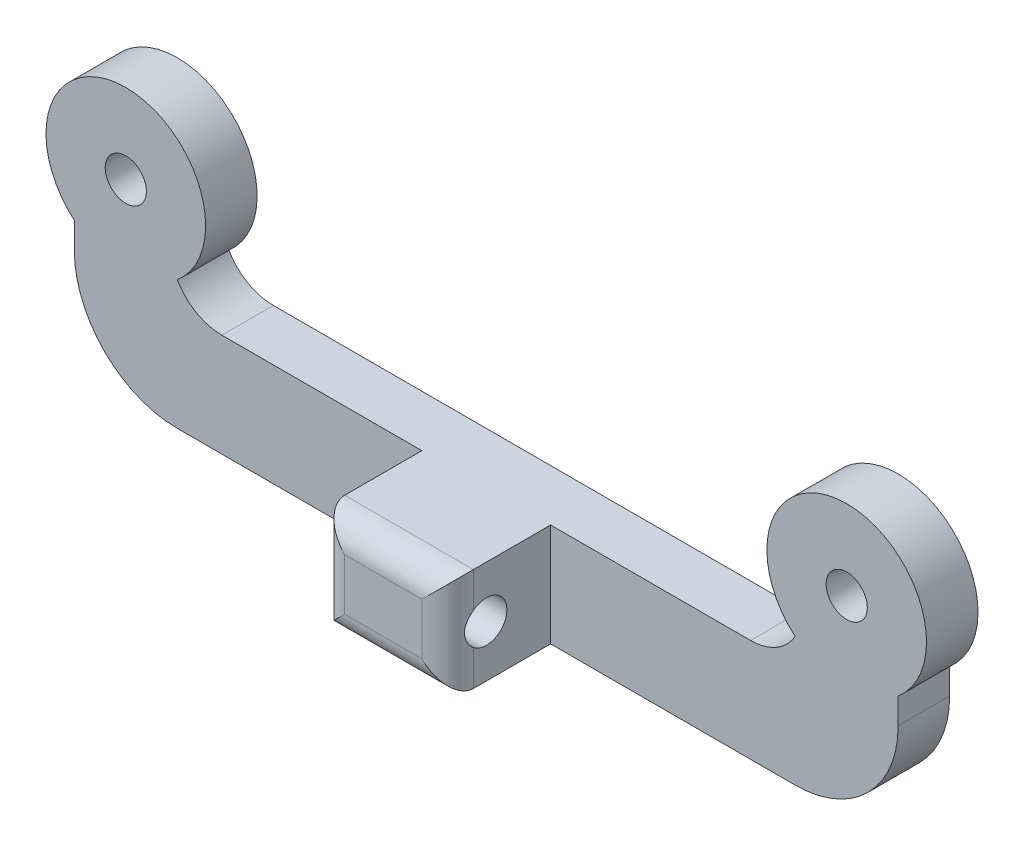
ISO-10303-21;
HEADER;
FILE_DESCRIPTION(('STEP AP214'),'2;1');
FILE_NAME('part.step','',(''),(''),'','','');
FILE_SCHEMA(('AUTOMOTIVE_DESIGN { 1 0 10303 214 1 1 1 1 }'));
ENDSEC;
DATA;
#1=APPLICATION_CONTEXT('core data for automotive mechanical design processes');
#2=APPLICATION_PROTOCOL_DEFINITION('international standard','automotive_design',2000,#1);
#3=PRODUCT_CONTEXT('',#1,'mechanical');
#4=PRODUCT('Part','Part','',(#3));
#5=PRODUCT_RELATED_PRODUCT_CATEGORY('part','',(#4));
#6=PRODUCT_DEFINITION_FORMATION('','',#4);
#7=PRODUCT_DEFINITION_CONTEXT('part definition',#1,'design');
#8=PRODUCT_DEFINITION('design','',#6,#7);
#9=PRODUCT_DEFINITION_SHAPE('','',#8);
#10=(LENGTH_UNIT() NAMED_UNIT(*) SI_UNIT(.MILLI.,.METRE.));
#11=(NAMED_UNIT(*) PLANE_ANGLE_UNIT() SI_UNIT($,.RADIAN.));
#12=(NAMED_UNIT(*) SI_UNIT($,.STERADIAN.) SOLID_ANGLE_UNIT());
#13=UNCERTAINTY_MEASURE_WITH_UNIT(LENGTH_MEASURE(1.E-05),#10,'distance_accuracy_value','');
#14=(GEOMETRIC_REPRESENTATION_CONTEXT(3) GLOBAL_UNCERTAINTY_ASSIGNED_CONTEXT((#13)) GLOBAL_UNIT_ASSIGNED_CONTEXT((#10,
#11,#12)) REPRESENTATION_CONTEXT('',''));
#15=CARTESIAN_POINT('',(0.,0.,0.));
#16=DIRECTION('',(0.,0.,1.));
#17=DIRECTION('',(1.,0.,0.));
#18=AXIS2_PLACEMENT_3D('',#15,#16,#17);
#19=CARTESIAN_POINT('',(56.,0.,4.));
#20=DIRECTION('',(0.,0.,1.));
#21=DIRECTION('',(1.,0.,0.));
#22=AXIS2_PLACEMENT_3D('',#19,#20,#21);
#23=PLANE('',#22);
#24=DIRECTION('',(0.,-1.,0.));
#25=VECTOR('',#24,1.);
#26=CARTESIAN_POINT('',(-4.,-4.7370877129308,4.));
#27=LINE('',#26,#25);
#28=CARTESIAN_POINT('',(-4.,-4.7370877129308,4.));
#29=VERTEX_POINT('',#28);
#30=CARTESIAN_POINT('',(-4.,-6.7370877129308,4.));
#31=VERTEX_POINT('',#30);
#32=EDGE_CURVE('E249',#29,#31,#27,.T.);
#33=ORIENTED_EDGE('',*,*,#32,.T.);
#34=CARTESIAN_POINT('',(4.,-6.7370877129308,4.));
#35=DIRECTION('',(0.,0.,1.));
#36=DIRECTION('',(1.,0.,0.));
#37=AXIS2_PLACEMENT_3D('',#34,#35,#36);
#38=CIRCLE('',#37,8.);
#39=CARTESIAN_POINT('',(4.,-14.7370877129308,4.));
#40=VERTEX_POINT('',#39);
#41=EDGE_CURVE('E241',#31,#40,#38,.T.);
#42=ORIENTED_EDGE('',*,*,#41,.T.);
#43=DIRECTION('',(1.,0.,0.));
#44=VECTOR('',#43,1.);
#45=CARTESIAN_POINT('',(-4.,-14.7370877129308,4.));
#46=LINE('',#45,#44);
#47=CARTESIAN_POINT('',(23.,-14.7370877129308,4.));
#48=VERTEX_POINT('',#47);
#49=EDGE_CURVE('E227',#40,#48,#46,.T.);
#50=ORIENTED_EDGE('',*,*,#49,.T.);
#51=DIRECTION('',(0.,-1.,0.));
#52=VECTOR('',#51,1.);
#53=CARTESIAN_POINT('',(23.,-6.73708771293081,4.));
#54=LINE('',#53,#52);
#55=CARTESIAN_POINT('',(23.,-6.7370877129308,4.));
#56=VERTEX_POINT('',#55);
#57=EDGE_CURVE('E187',#56,#48,#54,.T.);
#58=ORIENTED_EDGE('',*,*,#57,.F.);
#59=DIRECTION('',(-1.,0.,0.));
#60=VECTOR('',#59,1.);
#61=CARTESIAN_POINT('',(4.,-6.7370877129308,4.));
#62=LINE('',#61,#60);
#63=CARTESIAN_POINT('',(7.46410161513775,-6.7370877129308,4.));
#64=VERTEX_POINT('',#63);
#65=EDGE_CURVE('E171',#56,#64,#62,.T.);
#66=ORIENTED_EDGE('',*,*,#65,.T.);
#67=CARTESIAN_POINT('',(7.46410161513775,-2.7370877129308,4.));
#68=DIRECTION('',(0.,0.,1.));
#69=DIRECTION('',(1.,0.,0.));
#70=AXIS2_PLACEMENT_3D('',#67,#68,#69);
#71=CIRCLE('',#70,4.);
#72=CARTESIAN_POINT('',(4.,-4.7370877129308,4.));
#73=VERTEX_POINT('',#72);
#74=EDGE_CURVE('E11',#64,#73,#71,.F.);
#75=ORIENTED_EDGE('',*,*,#74,.T.);
#76=CARTESIAN_POINT('',(0.,0.,4.));
#77=DIRECTION('',(0.,0.,1.));
#78=DIRECTION('',(1.,0.,0.));
#79=AXIS2_PLACEMENT_3D('',#76,#77,#78);
#80=CIRCLE('',#79,6.2);
#81=EDGE_CURVE('E170',#73,#29,#80,.T.);
#82=ORIENTED_EDGE('',*,*,#81,.T.);
#83=EDGE_LOOP('',(#33,#42,#50,#58,#66,#75,#82));
#84=FACE_BOUND('',#83,.T.);
#85=CARTESIAN_POINT('',(0.,0.,4.));
#86=DIRECTION('',(0.,0.,1.));
#87=DIRECTION('',(1.,0.,0.));
#88=AXIS2_PLACEMENT_3D('',#85,#86,#87);
#89=CIRCLE('',#88,1.6);
#90=CARTESIAN_POINT('',(1.6,0.,4.));
#91=VERTEX_POINT('',#90);
#92=EDGE_CURVE('E213',#91,#91,#89,.T.);
#93=ORIENTED_EDGE('',*,*,#92,.F.);
#94=EDGE_LOOP('',(#93));
#95=FACE_BOUND('',#94,.T.);
#96=ADVANCED_FACE('F33',(#84,#95),#23,.T.);
#97=CARTESIAN_POINT('',(33.,-14.7370877129308,4.));
#98=VERTEX_POINT('',#97);
#99=CARTESIAN_POINT('',(52.,-14.7370877129308,4.));
#100=VERTEX_POINT('',#99);
#101=EDGE_CURVE('E224',#98,#100,#46,.T.);
#102=ORIENTED_EDGE('',*,*,#101,.T.);
#103=CARTESIAN_POINT('',(52.,-6.7370877129308,4.));
#104=DIRECTION('',(0.,0.,1.));
#105=DIRECTION('',(1.,0.,0.));
#106=AXIS2_PLACEMENT_3D('',#103,#104,#105);
#107=CIRCLE('',#106,8.);
#108=CARTESIAN_POINT('',(60.,-6.7370877129308,4.));
#109=VERTEX_POINT('',#108);
#110=EDGE_CURVE('E237',#100,#109,#107,.T.);
#111=ORIENTED_EDGE('',*,*,#110,.T.);
#112=DIRECTION('',(0.,1.,0.));
#113=VECTOR('',#112,1.);
#114=CARTESIAN_POINT('',(60.,-4.7370877129308,4.));
#115=LINE('',#114,#113);
#116=CARTESIAN_POINT('',(60.,-4.73708771293081,4.));
#117=VERTEX_POINT('',#116);
#118=EDGE_CURVE('E221',#109,#117,#115,.T.);
#119=ORIENTED_EDGE('',*,*,#118,.T.);
#120=CARTESIAN_POINT('',(56.,0.,4.));
#121=DIRECTION('',(0.,0.,1.));
#122=DIRECTION('',(1.,0.,0.));
#123=AXIS2_PLACEMENT_3D('',#120,#121,#122);
#124=CIRCLE('',#123,6.2);
#125=CARTESIAN_POINT('',(52.,-4.7370877129308,4.));
#126=VERTEX_POINT('',#125);
#127=EDGE_CURVE('E246',#117,#126,#124,.T.);
#128=ORIENTED_EDGE('',*,*,#127,.T.);
#129=CARTESIAN_POINT('',(48.5358983848623,-2.7370877129308,4.));
#130=DIRECTION('',(0.,0.,1.));
#131=DIRECTION('',(1.,0.,0.));
#132=AXIS2_PLACEMENT_3D('',#129,#130,#131);
#133=CIRCLE('',#132,4.);
#134=CARTESIAN_POINT('',(48.5358983848623,-6.7370877129308,4.));
#135=VERTEX_POINT('',#134);
#136=EDGE_CURVE('E167',#126,#135,#133,.F.);
#137=ORIENTED_EDGE('',*,*,#136,.T.);
#138=CARTESIAN_POINT('',(33.,-6.7370877129308,4.));
#139=VERTEX_POINT('',#138);
#140=EDGE_CURVE('E158',#135,#139,#62,.T.);
#141=ORIENTED_EDGE('',*,*,#140,.T.);
#142=DIRECTION('',(0.,1.,0.));
#143=VECTOR('',#142,1.);
#144=CARTESIAN_POINT('',(33.,-6.7370877129308,4.));
#145=LINE('',#144,#143);
#146=EDGE_CURVE('E164',#98,#139,#145,.T.);
#147=ORIENTED_EDGE('',*,*,#146,.F.);
#148=EDGE_LOOP('',(#102,#111,#119,#128,#137,#141,#147));
#149=FACE_BOUND('',#148,.T.);
#150=CARTESIAN_POINT('',(56.,0.,4.));
#151=DIRECTION('',(0.,0.,1.));
#152=DIRECTION('',(1.,0.,0.));
#153=AXIS2_PLACEMENT_3D('',#150,#151,#152);
#154=CIRCLE('',#153,1.6);
#155=CARTESIAN_POINT('',(57.6,0.,4.));
#156=VERTEX_POINT('',#155);
#157=EDGE_CURVE('E205',#156,#156,#154,.T.);
#158=ORIENTED_EDGE('',*,*,#157,.F.);
#159=EDGE_LOOP('',(#158));
#160=FACE_BOUND('',#159,.T.);
#161=ADVANCED_FACE('F161',(#149,#160),#23,.T.);
#162=CARTESIAN_POINT('',(56.,0.,0.));
#163=DIRECTION('',(0.,0.,1.));
#164=DIRECTION('',(1.,0.,0.));
#165=AXIS2_PLACEMENT_3D('',#162,#163,#164);
#166=PLANE('',#165);
#167=CARTESIAN_POINT('',(0.,0.,0.));
#168=DIRECTION('',(0.,0.,1.));
#169=DIRECTION('',(1.,0.,0.));
#170=AXIS2_PLACEMENT_3D('',#167,#168,#169);
#171=CIRCLE('',#170,1.6);
#172=CARTESIAN_POINT('',(1.6,0.,0.));
#173=VERTEX_POINT('',#172);
#174=EDGE_CURVE('E208',#173,#173,#171,.T.);
#175=ORIENTED_EDGE('',*,*,#174,.T.);
#176=EDGE_LOOP('',(#175));
#177=FACE_BOUND('',#176,.T.);
#178=DIRECTION('',(0.,1.,0.));
#179=VECTOR('',#178,1.);
#180=CARTESIAN_POINT('',(60.,-4.7370877129308,0.));
#181=LINE('',#180,#179);
#182=CARTESIAN_POINT('',(60.,-6.7370877129308,0.));
#183=VERTEX_POINT('',#182);
#184=CARTESIAN_POINT('',(60.,-4.73708771293081,0.));
#185=VERTEX_POINT('',#184);
#186=EDGE_CURVE('E255',#183,#185,#181,.T.);
#187=ORIENTED_EDGE('',*,*,#186,.F.);
#188=CARTESIAN_POINT('',(52.,-6.7370877129308,0.));
#189=DIRECTION('',(0.,0.,1.));
#190=DIRECTION('',(1.,0.,0.));
#191=AXIS2_PLACEMENT_3D('',#188,#189,#190);
#192=CIRCLE('',#191,8.);
#193=CARTESIAN_POINT('',(52.,-14.7370877129308,0.));
#194=VERTEX_POINT('',#193);
#195=EDGE_CURVE('E230',#183,#194,#192,.F.);
#196=ORIENTED_EDGE('',*,*,#195,.T.);
#197=DIRECTION('',(1.,0.,0.));
#198=VECTOR('',#197,1.);
#199=CARTESIAN_POINT('',(-4.,-14.7370877129308,0.));
#200=LINE('',#199,#198);
#201=CARTESIAN_POINT('',(4.,-14.7370877129308,0.));
#202=VERTEX_POINT('',#201);
#203=EDGE_CURVE('E216',#202,#194,#200,.T.);
#204=ORIENTED_EDGE('',*,*,#203,.F.);
#205=CARTESIAN_POINT('',(4.,-6.7370877129308,0.));
#206=DIRECTION('',(0.,0.,1.));
#207=DIRECTION('',(1.,0.,0.));
#208=AXIS2_PLACEMENT_3D('',#205,#206,#207);
#209=CIRCLE('',#208,8.);
#210=CARTESIAN_POINT('',(-4.,-6.7370877129308,0.));
#211=VERTEX_POINT('',#210);
#212=EDGE_CURVE('E333',#202,#211,#209,.F.);
#213=ORIENTED_EDGE('',*,*,#212,.T.);
#214=DIRECTION('',(0.,-1.,0.));
#215=VECTOR('',#214,1.);
#216=CARTESIAN_POINT('',(-4.,-4.7370877129308,0.));
#217=LINE('',#216,#215);
#218=CARTESIAN_POINT('',(-4.,-4.7370877129308,0.));
#219=VERTEX_POINT('',#218);
#220=EDGE_CURVE('E264',#219,#211,#217,.T.);
#221=ORIENTED_EDGE('',*,*,#220,.F.);
#222=CARTESIAN_POINT('',(0.,0.,0.));
#223=DIRECTION('',(0.,0.,1.));
#224=DIRECTION('',(1.,0.,0.));
#225=AXIS2_PLACEMENT_3D('',#222,#223,#224);
#226=CIRCLE('',#225,6.2);
#227=CARTESIAN_POINT('',(4.,-4.7370877129308,0.));
#228=VERTEX_POINT('',#227);
#229=EDGE_CURVE('E262',#228,#219,#226,.T.);
#230=ORIENTED_EDGE('',*,*,#229,.F.);
#231=CARTESIAN_POINT('',(7.46410161513775,-2.7370877129308,0.));
#232=DIRECTION('',(0.,0.,1.));
#233=DIRECTION('',(1.,0.,0.));
#234=AXIS2_PLACEMENT_3D('',#231,#232,#233);
#235=CIRCLE('',#234,4.);
#236=CARTESIAN_POINT('',(7.46410161513775,-6.7370877129308,0.));
#237=VERTEX_POINT('',#236);
#238=EDGE_CURVE('E41',#228,#237,#235,.T.);
#239=ORIENTED_EDGE('',*,*,#238,.T.);
#240=DIRECTION('',(-1.,0.,0.));
#241=VECTOR('',#240,1.);
#242=CARTESIAN_POINT('',(4.,-6.7370877129308,0.));
#243=LINE('',#242,#241);
#244=CARTESIAN_POINT('',(48.5358983848623,-6.7370877129308,0.));
#245=VERTEX_POINT('',#244);
#246=EDGE_CURVE('E260',#245,#237,#243,.T.);
#247=ORIENTED_EDGE('',*,*,#246,.F.);
#248=CARTESIAN_POINT('',(48.5358983848623,-2.7370877129308,0.));
#249=DIRECTION('',(0.,0.,1.));
#250=DIRECTION('',(1.,0.,0.));
#251=AXIS2_PLACEMENT_3D('',#248,#249,#250);
#252=CIRCLE('',#251,4.);
#253=CARTESIAN_POINT('',(52.,-4.7370877129308,0.));
#254=VERTEX_POINT('',#253);
#255=EDGE_CURVE('E564',#245,#254,#252,.T.);
#256=ORIENTED_EDGE('',*,*,#255,.T.);
#257=CARTESIAN_POINT('',(56.,0.,0.));
#258=DIRECTION('',(0.,0.,1.));
#259=DIRECTION('',(1.,0.,0.));
#260=AXIS2_PLACEMENT_3D('',#257,#258,#259);
#261=CIRCLE('',#260,6.2);
#262=EDGE_CURVE('E257',#185,#254,#261,.T.);
#263=ORIENTED_EDGE('',*,*,#262,.F.);
#264=EDGE_LOOP('',(#187,#196,#204,#213,#221,#230,#239,#247,#256,#263));
#265=FACE_BOUND('',#264,.T.);
#266=CARTESIAN_POINT('',(56.,0.,0.));
#267=DIRECTION('',(0.,0.,1.));
#268=DIRECTION('',(1.,0.,0.));
#269=AXIS2_PLACEMENT_3D('',#266,#267,#268);
#270=CIRCLE('',#269,1.6);
#271=CARTESIAN_POINT('',(57.6,0.,0.));
#272=VERTEX_POINT('',#271);
#273=EDGE_CURVE('E209',#272,#272,#270,.T.);
#274=ORIENTED_EDGE('',*,*,#273,.T.);
#275=EDGE_LOOP('',(#274));
#276=FACE_BOUND('',#275,.T.);
#277=ADVANCED_FACE('F337',(#177,#265,#276),#166,.F.);
#278=CARTESIAN_POINT('',(-4.,-14.7370877129308,4.));
#279=DIRECTION('',(0.,1.,0.));
#280=DIRECTION('',(0.,0.,1.));
#281=AXIS2_PLACEMENT_3D('',#278,#279,#280);
#282=PLANE('',#281);
#283=ORIENTED_EDGE('',*,*,#203,.T.);
#284=DIRECTION('',(0.,0.,-1.));
#285=VECTOR('',#284,1.);
#286=CARTESIAN_POINT('',(52.,-14.7370877129308,4.));
#287=LINE('',#286,#285);
#288=EDGE_CURVE('E235',#194,#100,#287,.F.);
#289=ORIENTED_EDGE('',*,*,#288,.T.);
#290=ORIENTED_EDGE('',*,*,#101,.F.);
#291=DIRECTION('',(0.,0.,-1.));
#292=VECTOR('',#291,1.);
#293=CARTESIAN_POINT('',(33.,-14.7370877129308,12.));
#294=LINE('',#293,#292);
#295=CARTESIAN_POINT('',(33.,-14.7370877129308,10.));
#296=VERTEX_POINT('',#295);
#297=EDGE_CURVE('E182',#296,#98,#294,.T.);
#298=ORIENTED_EDGE('',*,*,#297,.F.);
#299=DIRECTION('',(1.,0.,0.));
#300=VECTOR('',#299,1.);
#301=CARTESIAN_POINT('',(23.,-14.7370877129308,10.));
#302=LINE('',#301,#300);
#303=CARTESIAN_POINT('',(23.,-14.7370877129308,10.));
#304=VERTEX_POINT('',#303);
#305=EDGE_CURVE('E317',#296,#304,#302,.F.);
#306=ORIENTED_EDGE('',*,*,#305,.T.);
#307=DIRECTION('',(0.,0.,-1.));
#308=VECTOR('',#307,1.);
#309=CARTESIAN_POINT('',(23.,-14.7370877129308,12.));
#310=LINE('',#309,#308);
#311=EDGE_CURVE('E212',#304,#48,#310,.T.);
#312=ORIENTED_EDGE('',*,*,#311,.T.);
#313=ORIENTED_EDGE('',*,*,#49,.F.);
#314=DIRECTION('',(0.,0.,-1.));
#315=VECTOR('',#314,1.);
#316=CARTESIAN_POINT('',(4.,-14.7370877129308,4.));
#317=LINE('',#316,#315);
#318=EDGE_CURVE('E232',#40,#202,#317,.T.);
#319=ORIENTED_EDGE('',*,*,#318,.T.);
#320=EDGE_LOOP('',(#283,#289,#290,#298,#306,#312,#313,#319));
#321=FACE_BOUND('',#320,.T.);
#322=ADVANCED_FACE('F343',(#321),#282,.F.);
#323=CARTESIAN_POINT('',(60.,-4.7370877129308,4.));
#324=DIRECTION('',(-1.,0.,0.));
#325=DIRECTION('',(0.,0.,1.));
#326=AXIS2_PLACEMENT_3D('',#323,#324,#325);
#327=PLANE('',#326);
#328=ORIENTED_EDGE('',*,*,#118,.F.);
#329=DIRECTION('',(0.,0.,-1.));
#330=VECTOR('',#329,1.);
#331=CARTESIAN_POINT('',(60.,-6.7370877129308,4.));
#332=LINE('',#331,#330);
#333=EDGE_CURVE('E319',#109,#183,#332,.T.);
#334=ORIENTED_EDGE('',*,*,#333,.T.);
#335=ORIENTED_EDGE('',*,*,#186,.T.);
#336=DIRECTION('',(0.,0.,-1.));
#337=VECTOR('',#336,1.);
#338=CARTESIAN_POINT('',(60.,-4.73708771293081,4.));
#339=LINE('',#338,#337);
#340=EDGE_CURVE('E274',#117,#185,#339,.T.);
#341=ORIENTED_EDGE('',*,*,#340,.F.);
#342=EDGE_LOOP('',(#328,#334,#335,#341));
#343=FACE_BOUND('',#342,.T.);
#344=ADVANCED_FACE('F350',(#343),#327,.F.);
#345=CARTESIAN_POINT('',(56.,0.,4.));
#346=DIRECTION('',(0.,0.,-1.));
#347=DIRECTION('',(-1.,0.,0.));
#348=AXIS2_PLACEMENT_3D('',#345,#346,#347);
#349=CYLINDRICAL_SURFACE('',#348,6.2);
#350=ORIENTED_EDGE('',*,*,#262,.T.);
#351=DIRECTION('',(0.,0.,-1.));
#352=VECTOR('',#351,1.);
#353=CARTESIAN_POINT('',(52.,-4.7370877129308,4.));
#354=LINE('',#353,#352);
#355=EDGE_CURVE('E272',#126,#254,#354,.T.);
#356=ORIENTED_EDGE('',*,*,#355,.F.);
#357=ORIENTED_EDGE('',*,*,#127,.F.);
#358=ORIENTED_EDGE('',*,*,#340,.T.);
#359=EDGE_LOOP('',(#350,#356,#357,#358));
#360=FACE_BOUND('',#359,.T.);
#361=ADVANCED_FACE('F433',(#360),#349,.T.);
#362=CARTESIAN_POINT('',(4.,-6.7370877129308,4.));
#363=DIRECTION('',(0.,-1.,0.));
#364=DIRECTION('',(0.,0.,-1.));
#365=AXIS2_PLACEMENT_3D('',#362,#363,#364);
#366=PLANE('',#365);
#367=ORIENTED_EDGE('',*,*,#140,.F.);
#368=DIRECTION('',(0.,0.,-1.));
#369=VECTOR('',#368,1.);
#370=CARTESIAN_POINT('',(48.5358983848623,-6.7370877129308,4.));
#371=LINE('',#370,#369);
#372=EDGE_CURVE('E563',#135,#245,#371,.T.);
#373=ORIENTED_EDGE('',*,*,#372,.T.);
#374=ORIENTED_EDGE('',*,*,#246,.T.);
#375=DIRECTION('',(0.,0.,-1.));
#376=VECTOR('',#375,1.);
#377=CARTESIAN_POINT('',(7.46410161513775,-6.7370877129308,4.));
#378=LINE('',#377,#376);
#379=EDGE_CURVE('E48',#237,#64,#378,.F.);
#380=ORIENTED_EDGE('',*,*,#379,.T.);
#381=ORIENTED_EDGE('',*,*,#65,.F.);
#382=DIRECTION('',(0.,0.,-1.));
#383=VECTOR('',#382,1.);
#384=CARTESIAN_POINT('',(23.,-6.73708771293081,12.));
#385=LINE('',#384,#383);
#386=CARTESIAN_POINT('',(23.,-6.73708771293081,10.));
#387=VERTEX_POINT('',#386);
#388=EDGE_CURVE('E183',#387,#56,#385,.T.);
#389=ORIENTED_EDGE('',*,*,#388,.F.);
#390=DIRECTION('',(-1.,0.,0.));
#391=VECTOR('',#390,1.);
#392=CARTESIAN_POINT('',(33.,-6.7370877129308,10.));
#393=LINE('',#392,#391);
#394=CARTESIAN_POINT('',(33.,-6.7370877129308,10.));
#395=VERTEX_POINT('',#394);
#396=EDGE_CURVE('E178',#387,#395,#393,.F.);
#397=ORIENTED_EDGE('',*,*,#396,.T.);
#398=DIRECTION('',(0.,0.,-1.));
#399=VECTOR('',#398,1.);
#400=CARTESIAN_POINT('',(33.,-6.7370877129308,12.));
#401=LINE('',#400,#399);
#402=EDGE_CURVE('E174',#395,#139,#401,.T.);
#403=ORIENTED_EDGE('',*,*,#402,.T.);
#404=EDGE_LOOP('',(#367,#373,#374,#380,#381,#389,#397,#403));
#405=FACE_BOUND('',#404,.T.);
#406=ADVANCED_FACE('F175',(#405),#366,.F.);
#407=CARTESIAN_POINT('',(0.,0.,4.));
#408=DIRECTION('',(0.,0.,-1.));
#409=DIRECTION('',(-1.,0.,0.));
#410=AXIS2_PLACEMENT_3D('',#407,#408,#409);
#411=CYLINDRICAL_SURFACE('',#410,6.2);
#412=ORIENTED_EDGE('',*,*,#229,.T.);
#413=DIRECTION('',(0.,0.,-1.));
#414=VECTOR('',#413,1.);
#415=CARTESIAN_POINT('',(-4.,-4.7370877129308,4.));
#416=LINE('',#415,#414);
#417=EDGE_CURVE('E252',#29,#219,#416,.T.);
#418=ORIENTED_EDGE('',*,*,#417,.F.);
#419=ORIENTED_EDGE('',*,*,#81,.F.);
#420=DIRECTION('',(0.,0.,-1.));
#421=VECTOR('',#420,1.);
#422=CARTESIAN_POINT('',(4.,-4.7370877129308,4.));
#423=LINE('',#422,#421);
#424=EDGE_CURVE('E269',#73,#228,#423,.T.);
#425=ORIENTED_EDGE('',*,*,#424,.T.);
#426=EDGE_LOOP('',(#412,#418,#419,#425));
#427=FACE_BOUND('',#426,.T.);
#428=ADVANCED_FACE('F360',(#427),#411,.T.);
#429=CARTESIAN_POINT('',(-4.,-4.7370877129308,4.));
#430=DIRECTION('',(1.,0.,0.));
#431=DIRECTION('',(0.,1.,0.));
#432=AXIS2_PLACEMENT_3D('',#429,#430,#431);
#433=PLANE('',#432);
#434=ORIENTED_EDGE('',*,*,#220,.T.);
#435=DIRECTION('',(0.,0.,-1.));
#436=VECTOR('',#435,1.);
#437=CARTESIAN_POINT('',(-4.,-6.7370877129308,4.));
#438=LINE('',#437,#436);
#439=EDGE_CURVE('E239',#211,#31,#438,.F.);
#440=ORIENTED_EDGE('',*,*,#439,.T.);
#441=ORIENTED_EDGE('',*,*,#32,.F.);
#442=ORIENTED_EDGE('',*,*,#417,.T.);
#443=EDGE_LOOP('',(#434,#440,#441,#442));
#444=FACE_BOUND('',#443,.T.);
#445=ADVANCED_FACE('F364',(#444),#433,.F.);
#446=CARTESIAN_POINT('',(0.,0.,4.));
#447=DIRECTION('',(0.,0.,-1.));
#448=DIRECTION('',(-1.,0.,0.));
#449=AXIS2_PLACEMENT_3D('',#446,#447,#448);
#450=CYLINDRICAL_SURFACE('',#449,1.6);
#451=ORIENTED_EDGE('',*,*,#92,.T.);
#452=EDGE_LOOP('',(#451));
#453=FACE_BOUND('',#452,.T.);
#454=ORIENTED_EDGE('',*,*,#174,.F.);
#455=EDGE_LOOP('',(#454));
#456=FACE_BOUND('',#455,.T.);
#457=ADVANCED_FACE('F417',(#453,#456),#450,.F.);
#458=CARTESIAN_POINT('',(56.,0.,4.));
#459=DIRECTION('',(0.,0.,-1.));
#460=DIRECTION('',(-1.,0.,0.));
#461=AXIS2_PLACEMENT_3D('',#458,#459,#460);
#462=CYLINDRICAL_SURFACE('',#461,1.6);
#463=ORIENTED_EDGE('',*,*,#157,.T.);
#464=EDGE_LOOP('',(#463));
#465=FACE_BOUND('',#464,.T.);
#466=ORIENTED_EDGE('',*,*,#273,.F.);
#467=EDGE_LOOP('',(#466));
#468=FACE_BOUND('',#467,.T.);
#469=ADVANCED_FACE('F414',(#465,#468),#462,.F.);
#470=CARTESIAN_POINT('',(23.,-6.73708771293081,12.));
#471=DIRECTION('',(1.,0.,0.));
#472=DIRECTION('',(0.,0.,-1.));
#473=AXIS2_PLACEMENT_3D('',#470,#471,#472);
#474=PLANE('',#473);
#475=ORIENTED_EDGE('',*,*,#311,.F.);
#476=DIRECTION('',(0.,-1.,0.));
#477=VECTOR('',#476,1.);
#478=CARTESIAN_POINT('',(23.,-6.73708771293081,10.));
#479=LINE('',#478,#477);
#480=CARTESIAN_POINT('',(23.,-11.9860873126105,10.));
#481=VERTEX_POINT('',#480);
#482=EDGE_CURVE('E314',#304,#481,#479,.F.);
#483=ORIENTED_EDGE('',*,*,#482,.T.);
#484=CARTESIAN_POINT('',(23.,-10.7370877129308,9.));
#485=DIRECTION('',(-1.,0.,0.));
#486=DIRECTION('',(0.,0.,1.));
#487=AXIS2_PLACEMENT_3D('',#484,#485,#486);
#488=CIRCLE('',#487,1.6);
#489=CARTESIAN_POINT('',(23.,-9.48808811325112,10.));
#490=VERTEX_POINT('',#489);
#491=EDGE_CURVE('E331',#490,#481,#488,.T.);
#492=ORIENTED_EDGE('',*,*,#491,.F.);
#493=DIRECTION('',(0.,-1.,0.));
#494=VECTOR('',#493,1.);
#495=CARTESIAN_POINT('',(23.,-6.73708771293081,10.));
#496=LINE('',#495,#494);
#497=EDGE_CURVE('E312',#490,#387,#496,.F.);
#498=ORIENTED_EDGE('',*,*,#497,.T.);
#499=ORIENTED_EDGE('',*,*,#388,.T.);
#500=ORIENTED_EDGE('',*,*,#57,.T.);
#501=EDGE_LOOP('',(#475,#483,#492,#498,#499,#500));
#502=FACE_BOUND('',#501,.T.);
#503=ADVANCED_FACE('F373',(#502),#474,.F.);
#504=CARTESIAN_POINT('',(33.,-6.7370877129308,12.));
#505=DIRECTION('',(-1.,0.,0.));
#506=DIRECTION('',(0.,0.,1.));
#507=AXIS2_PLACEMENT_3D('',#504,#505,#506);
#508=PLANE('',#507);
#509=ORIENTED_EDGE('',*,*,#402,.F.);
#510=DIRECTION('',(0.,1.,0.));
#511=VECTOR('',#510,1.);
#512=CARTESIAN_POINT('',(33.,-14.7370877129308,10.));
#513=LINE('',#512,#511);
#514=CARTESIAN_POINT('',(33.,-9.48808811325112,10.));
#515=VERTEX_POINT('',#514);
#516=EDGE_CURVE('E389',#395,#515,#513,.F.);
#517=ORIENTED_EDGE('',*,*,#516,.T.);
#518=CARTESIAN_POINT('',(33.,-10.7370877129308,9.));
#519=DIRECTION('',(-1.,0.,0.));
#520=DIRECTION('',(0.,0.,1.));
#521=AXIS2_PLACEMENT_3D('',#518,#519,#520);
#522=CIRCLE('',#521,1.6);
#523=CARTESIAN_POINT('',(33.,-11.9860873126105,10.));
#524=VERTEX_POINT('',#523);
#525=EDGE_CURVE('E191',#524,#515,#522,.F.);
#526=ORIENTED_EDGE('',*,*,#525,.F.);
#527=DIRECTION('',(0.,1.,0.));
#528=VECTOR('',#527,1.);
#529=CARTESIAN_POINT('',(33.,-14.7370877129308,10.));
#530=LINE('',#529,#528);
#531=EDGE_CURVE('E294',#524,#296,#530,.F.);
#532=ORIENTED_EDGE('',*,*,#531,.T.);
#533=ORIENTED_EDGE('',*,*,#297,.T.);
#534=ORIENTED_EDGE('',*,*,#146,.T.);
#535=EDGE_LOOP('',(#509,#517,#526,#532,#533,#534));
#536=FACE_BOUND('',#535,.T.);
#537=ADVANCED_FACE('F185',(#536),#508,.F.);
#538=CARTESIAN_POINT('',(0.,0.,12.));
#539=DIRECTION('',(0.,0.,1.));
#540=DIRECTION('',(1.,0.,0.));
#541=AXIS2_PLACEMENT_3D('',#538,#539,#540);
#542=PLANE('',#541);
#543=DIRECTION('',(0.,1.,0.));
#544=VECTOR('',#543,1.);
#545=CARTESIAN_POINT('',(31.,-6.7370877129308,12.));
#546=LINE('',#545,#544);
#547=CARTESIAN_POINT('',(31.,-12.7370877129308,12.));
#548=VERTEX_POINT('',#547);
#549=CARTESIAN_POINT('',(31.,-8.7370877129308,12.));
#550=VERTEX_POINT('',#549);
#551=EDGE_CURVE('E287',#548,#550,#546,.T.);
#552=ORIENTED_EDGE('',*,*,#551,.T.);
#553=DIRECTION('',(-1.,0.,0.));
#554=VECTOR('',#553,1.);
#555=CARTESIAN_POINT('',(23.,-8.7370877129308,12.));
#556=LINE('',#555,#554);
#557=CARTESIAN_POINT('',(25.,-8.7370877129308,12.));
#558=VERTEX_POINT('',#557);
#559=EDGE_CURVE('E293',#550,#558,#556,.T.);
#560=ORIENTED_EDGE('',*,*,#559,.T.);
#561=DIRECTION('',(0.,-1.,0.));
#562=VECTOR('',#561,1.);
#563=CARTESIAN_POINT('',(25.,-14.7370877129308,12.));
#564=LINE('',#563,#562);
#565=CARTESIAN_POINT('',(25.,-12.7370877129308,12.));
#566=VERTEX_POINT('',#565);
#567=EDGE_CURVE('E281',#558,#566,#564,.T.);
#568=ORIENTED_EDGE('',*,*,#567,.T.);
#569=DIRECTION('',(1.,0.,0.));
#570=VECTOR('',#569,1.);
#571=CARTESIAN_POINT('',(33.,-12.7370877129308,12.));
#572=LINE('',#571,#570);
#573=EDGE_CURVE('E276',#566,#548,#572,.T.);
#574=ORIENTED_EDGE('',*,*,#573,.T.);
#575=EDGE_LOOP('',(#552,#560,#568,#574));
#576=FACE_BOUND('',#575,.T.);
#577=ADVANCED_FACE('F405',(#576),#542,.T.);
#578=CARTESIAN_POINT('',(62.201,-10.7370877129308,9.));
#579=DIRECTION('',(-1.,0.,0.));
#580=DIRECTION('',(0.,0.,1.));
#581=AXIS2_PLACEMENT_3D('',#578,#579,#580);
#582=CYLINDRICAL_SURFACE('',#581,1.6);
#583=ORIENTED_EDGE('',*,*,#491,.T.);
#584=CARTESIAN_POINT('',(23.,-11.9860873126105,10.));
#585=CARTESIAN_POINT('',(22.9999993559734,-11.9583502592157,10.0346462395051));
#586=CARTESIAN_POINT('',(23.0009002039694,-11.9291900752005,10.0681088382742));
#587=CARTESIAN_POINT('',(23.0041306999931,-11.8682507038677,10.1324452054838));
#588=CARTESIAN_POINT('',(23.006459429436,-11.8364732116855,10.1633206238064));
#589=CARTESIAN_POINT('',(23.0150169164172,-11.7376381633769,10.2516743298706));
#590=CARTESIAN_POINT('',(23.0228201297238,-11.66695919662,10.3050279486858));
#591=CARTESIAN_POINT('',(23.0396644576238,-11.5180684898146,10.399225094104));
#592=CARTESIAN_POINT('',(23.0487036412819,-11.4398685550859,10.4400878190101));
#593=CARTESIAN_POINT('',(23.0653956157477,-11.2776752343233,10.5084771052936));
#594=CARTESIAN_POINT('',(23.0730484335836,-11.1936819612785,10.5360039266811));
#595=CARTESIAN_POINT('',(23.0850165099016,-11.0201490779698,10.577340450326));
#596=CARTESIAN_POINT('',(23.0892541589458,-10.9305278611808,10.5908331062224));
#597=CARTESIAN_POINT('',(23.0928965584347,-10.7502130544017,10.6024928561739));
#598=CARTESIAN_POINT('',(23.0923029721345,-10.6595198442045,10.6006652245561));
#599=CARTESIAN_POINT('',(23.0865929504131,-10.4839000848738,10.5821976650696));
#600=CARTESIAN_POINT('',(23.0816780548487,-10.398896063488,10.5662175503069));
#601=CARTESIAN_POINT('',(23.068874265902,-10.2327179466679,10.5208668779799));
#602=CARTESIAN_POINT('',(23.0609829610285,-10.1515470169741,10.4914854586074));
#603=CARTESIAN_POINT('',(23.0440725399581,-9.99307083472429,10.4192329808007));
#604=CARTESIAN_POINT('',(23.0350298547342,-9.91591629004008,10.3760380138994));
#605=CARTESIAN_POINT('',(23.0187163389806,-9.76972289048775,10.2774762955987));
#606=CARTESIAN_POINT('',(23.0114421545913,-9.70066880439001,10.2221329683899));
#607=CARTESIAN_POINT('',(23.0044891719505,-9.61005901755263,10.1362876948085));
#608=CARTESIAN_POINT('',(23.0028568689952,-9.58436288899236,10.1102102990544));
#609=CARTESIAN_POINT('',(23.0006126490429,-9.534819264009,10.0563553446216));
#610=CARTESIAN_POINT('',(22.9999998793483,-9.51097023867631,10.0285792268681));
#611=CARTESIAN_POINT('',(23.,-9.48808811325112,10.));
#612=B_SPLINE_CURVE_WITH_KNOTS('',3,(#584,#585,#586,#587,#588,#589,#590,#591,#592,#593,#594,
#595,#596,#597,#598,#599,#600,#601,#602,#603,#604,#605,#606,#607,#608,#609,#610,#611),
.UNSPECIFIED.,.F.,.F.,(4,2,2,2,2,2,2,2,2,2,2,2,2,4),(0.,0.133035993810696,0.265986492545871,
0.531326037257326,0.796255684662105,1.0611801665276,1.33196752676627,1.60266166666071,
1.86136330281575,2.12027499124519,2.38576794331623,2.65075340566711,2.76061030830083,
2.8703752846545),.UNSPECIFIED.);
#613=EDGE_CURVE('E393',#481,#490,#612,.T.);
#614=ORIENTED_EDGE('',*,*,#613,.T.);
#615=EDGE_LOOP('',(#583,#614));
#616=FACE_BOUND('',#615,.T.);
#617=ORIENTED_EDGE('',*,*,#525,.T.);
#618=CARTESIAN_POINT('',(33.,-9.48808811325112,10.));
#619=CARTESIAN_POINT('',(33.0000006440266,-9.51582516664594,10.0346462395051));
#620=CARTESIAN_POINT('',(32.9990997960306,-9.54498535066115,10.0681088382742));
#621=CARTESIAN_POINT('',(32.9958693000069,-9.60592472199396,10.1324452054838));
#622=CARTESIAN_POINT('',(32.993540570564,-9.63770221417607,10.1633206238064));
#623=CARTESIAN_POINT('',(32.9849830835828,-9.73653726248468,10.2516743298706));
#624=CARTESIAN_POINT('',(32.9771798702762,-9.80721622924163,10.3050279486858));
#625=CARTESIAN_POINT('',(32.9603355423762,-9.95610693604701,10.399225094104));
#626=CARTESIAN_POINT('',(32.9512963587181,-10.0343068707757,10.4400878190101));
#627=CARTESIAN_POINT('',(32.9346043842523,-10.1965001915384,10.5084771052936));
#628=CARTESIAN_POINT('',(32.9269515664164,-10.2804934645831,10.5360039266811));
#629=CARTESIAN_POINT('',(32.9149834900984,-10.4540263478919,10.577340450326));
#630=CARTESIAN_POINT('',(32.9107458410542,-10.5436475646809,10.5908331062224));
#631=CARTESIAN_POINT('',(32.9071034415653,-10.7239623714599,10.6024928561739));
#632=CARTESIAN_POINT('',(32.9076970278655,-10.8146555816571,10.6006652245561));
#633=CARTESIAN_POINT('',(32.9134070495869,-10.9902753409878,10.5821976650696));
#634=CARTESIAN_POINT('',(32.9183219451513,-11.0752793623736,10.5662175503069));
#635=CARTESIAN_POINT('',(32.931125734098,-11.2414574791937,10.5208668779799));
#636=CARTESIAN_POINT('',(32.9390170389715,-11.3226284088875,10.4914854586075));
#637=CARTESIAN_POINT('',(32.9559274600419,-11.4811045911373,10.4192329808007));
#638=CARTESIAN_POINT('',(32.9649701452658,-11.5582591358215,10.3760380138994));
#639=CARTESIAN_POINT('',(32.9812836610194,-11.7044525353739,10.2774762955987));
#640=CARTESIAN_POINT('',(32.9885578454087,-11.7735066214716,10.2221329683899));
#641=CARTESIAN_POINT('',(32.9955108280495,-11.864116408309,10.1362876948085));
#642=CARTESIAN_POINT('',(32.9971431310048,-11.8898125368692,10.1102102990544));
#643=CARTESIAN_POINT('',(32.9993873509571,-11.9393561618526,10.0563553446216));
#644=CARTESIAN_POINT('',(33.0000001206517,-11.9632051871853,10.0285792268681));
#645=CARTESIAN_POINT('',(33.,-11.9860873126105,10.));
#646=B_SPLINE_CURVE_WITH_KNOTS('',3,(#618,#619,#620,#621,#622,#623,#624,#625,#626,#627,#628,
#629,#630,#631,#632,#633,#634,#635,#636,#637,#638,#639,#640,#641,#642,#643,#644,#645),
.UNSPECIFIED.,.F.,.F.,(4,2,2,2,2,2,2,2,2,2,2,2,2,4),(0.,0.133035993810696,0.265986492545871,
0.531326037257326,0.796255684662105,1.0611801665276,1.33196752676627,1.6026616666607,
1.86136330281575,2.12027499124519,2.38576794331622,2.65075340566711,2.76061030830083,
2.87037528465451),.UNSPECIFIED.);
#647=EDGE_CURVE('E304',#515,#524,#646,.T.);
#648=ORIENTED_EDGE('',*,*,#647,.T.);
#649=EDGE_LOOP('',(#617,#648));
#650=FACE_BOUND('',#649,.T.);
#651=ADVANCED_FACE('F401',(#616,#650),#582,.F.);
#652=CARTESIAN_POINT('',(25.,0.,10.));
#653=DIRECTION('',(0.,1.,0.));
#654=DIRECTION('',(0.,0.,1.));
#655=AXIS2_PLACEMENT_3D('',#652,#653,#654);
#656=CYLINDRICAL_SURFACE('',#655,2.);
#657=ORIENTED_EDGE('',*,*,#613,.F.);
#658=ORIENTED_EDGE('',*,*,#482,.F.);
#659=CARTESIAN_POINT('',(25.,-12.7370877129308,10.));
#660=DIRECTION('',(-0.707106781186547,0.707106781186547,0.));
#661=DIRECTION('',(-0.707106781186547,-0.707106781186547,0.));
#662=AXIS2_PLACEMENT_3D('',#659,#660,#661);
#663=ELLIPSE('',#662,2.82842712474619,2.);
#664=EDGE_CURVE('E328',#566,#304,#663,.F.);
#665=ORIENTED_EDGE('',*,*,#664,.F.);
#666=ORIENTED_EDGE('',*,*,#567,.F.);
#667=CARTESIAN_POINT('',(25.,-8.7370877129308,10.));
#668=DIRECTION('',(0.707106781186547,0.707106781186547,0.));
#669=DIRECTION('',(0.707106781186547,-0.707106781186547,0.));
#670=AXIS2_PLACEMENT_3D('',#667,#668,#669);
#671=ELLIPSE('',#670,2.82842712474619,2.);
#672=EDGE_CURVE('E325',#387,#558,#671,.T.);
#673=ORIENTED_EDGE('',*,*,#672,.F.);
#674=ORIENTED_EDGE('',*,*,#497,.F.);
#675=EDGE_LOOP('',(#657,#658,#665,#666,#673,#674));
#676=FACE_BOUND('',#675,.T.);
#677=ADVANCED_FACE('F380',(#676),#656,.T.);
#678=CARTESIAN_POINT('',(0.,-12.7370877129308,10.));
#679=DIRECTION('',(-1.,0.,0.));
#680=DIRECTION('',(0.,0.,1.));
#681=AXIS2_PLACEMENT_3D('',#678,#679,#680);
#682=CYLINDRICAL_SURFACE('',#681,2.);
#683=ORIENTED_EDGE('',*,*,#664,.T.);
#684=ORIENTED_EDGE('',*,*,#305,.F.);
#685=CARTESIAN_POINT('',(31.,-12.7370877129308,10.));
#686=DIRECTION('',(-0.707106781186547,-0.707106781186547,0.));
#687=DIRECTION('',(-0.707106781186547,0.707106781186547,0.));
#688=AXIS2_PLACEMENT_3D('',#685,#686,#687);
#689=ELLIPSE('',#688,2.82842712474619,2.);
#690=EDGE_CURVE('E322',#548,#296,#689,.F.);
#691=ORIENTED_EDGE('',*,*,#690,.F.);
#692=ORIENTED_EDGE('',*,*,#573,.F.);
#693=EDGE_LOOP('',(#683,#684,#691,#692));
#694=FACE_BOUND('',#693,.T.);
#695=ADVANCED_FACE('F443',(#694),#682,.T.);
#696=CARTESIAN_POINT('',(0.,-8.7370877129308,10.));
#697=DIRECTION('',(1.,0.,0.));
#698=DIRECTION('',(0.,0.,-1.));
#699=AXIS2_PLACEMENT_3D('',#696,#697,#698);
#700=CYLINDRICAL_SURFACE('',#699,2.);
#701=ORIENTED_EDGE('',*,*,#672,.T.);
#702=ORIENTED_EDGE('',*,*,#559,.F.);
#703=CARTESIAN_POINT('',(31.,-8.7370877129308,10.));
#704=DIRECTION('',(0.707106781186547,-0.707106781186547,0.));
#705=DIRECTION('',(0.707106781186547,0.707106781186547,0.));
#706=AXIS2_PLACEMENT_3D('',#703,#704,#705);
#707=ELLIPSE('',#706,2.82842712474619,2.);
#708=EDGE_CURVE('E320',#395,#550,#707,.T.);
#709=ORIENTED_EDGE('',*,*,#708,.F.);
#710=ORIENTED_EDGE('',*,*,#396,.F.);
#711=EDGE_LOOP('',(#701,#702,#709,#710));
#712=FACE_BOUND('',#711,.T.);
#713=ADVANCED_FACE('F385',(#712),#700,.T.);
#714=CARTESIAN_POINT('',(31.,0.,10.));
#715=DIRECTION('',(0.,-1.,0.));
#716=DIRECTION('',(0.,0.,-1.));
#717=AXIS2_PLACEMENT_3D('',#714,#715,#716);
#718=CYLINDRICAL_SURFACE('',#717,2.);
#719=ORIENTED_EDGE('',*,*,#647,.F.);
#720=ORIENTED_EDGE('',*,*,#516,.F.);
#721=ORIENTED_EDGE('',*,*,#708,.T.);
#722=ORIENTED_EDGE('',*,*,#551,.F.);
#723=ORIENTED_EDGE('',*,*,#690,.T.);
#724=ORIENTED_EDGE('',*,*,#531,.F.);
#725=EDGE_LOOP('',(#719,#720,#721,#722,#723,#724));
#726=FACE_BOUND('',#725,.T.);
#727=ADVANCED_FACE('F388',(#726),#718,.T.);
#728=CARTESIAN_POINT('',(52.,-6.7370877129308,4.));
#729=DIRECTION('',(0.,0.,-1.));
#730=DIRECTION('',(-1.,0.,0.));
#731=AXIS2_PLACEMENT_3D('',#728,#729,#730);
#732=CYLINDRICAL_SURFACE('',#731,8.);
#733=ORIENTED_EDGE('',*,*,#110,.F.);
#734=ORIENTED_EDGE('',*,*,#288,.F.);
#735=ORIENTED_EDGE('',*,*,#195,.F.);
#736=ORIENTED_EDGE('',*,*,#333,.F.);
#737=EDGE_LOOP('',(#733,#734,#735,#736));
#738=FACE_BOUND('',#737,.T.);
#739=ADVANCED_FACE('F347',(#738),#732,.T.);
#740=CARTESIAN_POINT('',(4.,-6.7370877129308,4.));
#741=DIRECTION('',(0.,0.,-1.));
#742=DIRECTION('',(-1.,0.,0.));
#743=AXIS2_PLACEMENT_3D('',#740,#741,#742);
#744=CYLINDRICAL_SURFACE('',#743,8.);
#745=ORIENTED_EDGE('',*,*,#41,.F.);
#746=ORIENTED_EDGE('',*,*,#439,.F.);
#747=ORIENTED_EDGE('',*,*,#212,.F.);
#748=ORIENTED_EDGE('',*,*,#318,.F.);
#749=EDGE_LOOP('',(#745,#746,#747,#748));
#750=FACE_BOUND('',#749,.T.);
#751=ADVANCED_FACE('F368',(#750),#744,.T.);
#752=CARTESIAN_POINT('',(48.5358983848623,-2.7370877129308,4.));
#753=DIRECTION('',(0.,0.,-1.));
#754=DIRECTION('',(-1.,0.,0.));
#755=AXIS2_PLACEMENT_3D('',#752,#753,#754);
#756=CYLINDRICAL_SURFACE('',#755,4.);
#757=ORIENTED_EDGE('',*,*,#136,.F.);
#758=ORIENTED_EDGE('',*,*,#355,.T.);
#759=ORIENTED_EDGE('',*,*,#255,.F.);
#760=ORIENTED_EDGE('',*,*,#372,.F.);
#761=EDGE_LOOP('',(#757,#758,#759,#760));
#762=FACE_BOUND('',#761,.T.);
#763=ADVANCED_FACE('F542',(#762),#756,.F.);
#764=CARTESIAN_POINT('',(7.46410161513775,-2.7370877129308,4.));
#765=DIRECTION('',(0.,0.,-1.));
#766=DIRECTION('',(-1.,0.,0.));
#767=AXIS2_PLACEMENT_3D('',#764,#765,#766);
#768=CYLINDRICAL_SURFACE('',#767,4.);
#769=ORIENTED_EDGE('',*,*,#74,.F.);
#770=ORIENTED_EDGE('',*,*,#379,.F.);
#771=ORIENTED_EDGE('',*,*,#238,.F.);
#772=ORIENTED_EDGE('',*,*,#424,.F.);
#773=EDGE_LOOP('',(#769,#770,#771,#772));
#774=FACE_BOUND('',#773,.T.);
#775=ADVANCED_FACE('F35',(#774),#768,.F.);
#776=CLOSED_SHELL('',(#96,#161,#277,#322,#344,#361,#406,#428,#445,#457,#469,#503,#537,#577,#651,
#677,#695,#713,#727,#739,#751,#763,#775));
#777=MANIFOLD_SOLID_BREP('B2',#776);
#778=ADVANCED_BREP_SHAPE_REPRESENTATION('',(#18,#777),#14);
#779=SHAPE_DEFINITION_REPRESENTATION(#9,#778);
ENDSEC;
END-ISO-10303-21;
